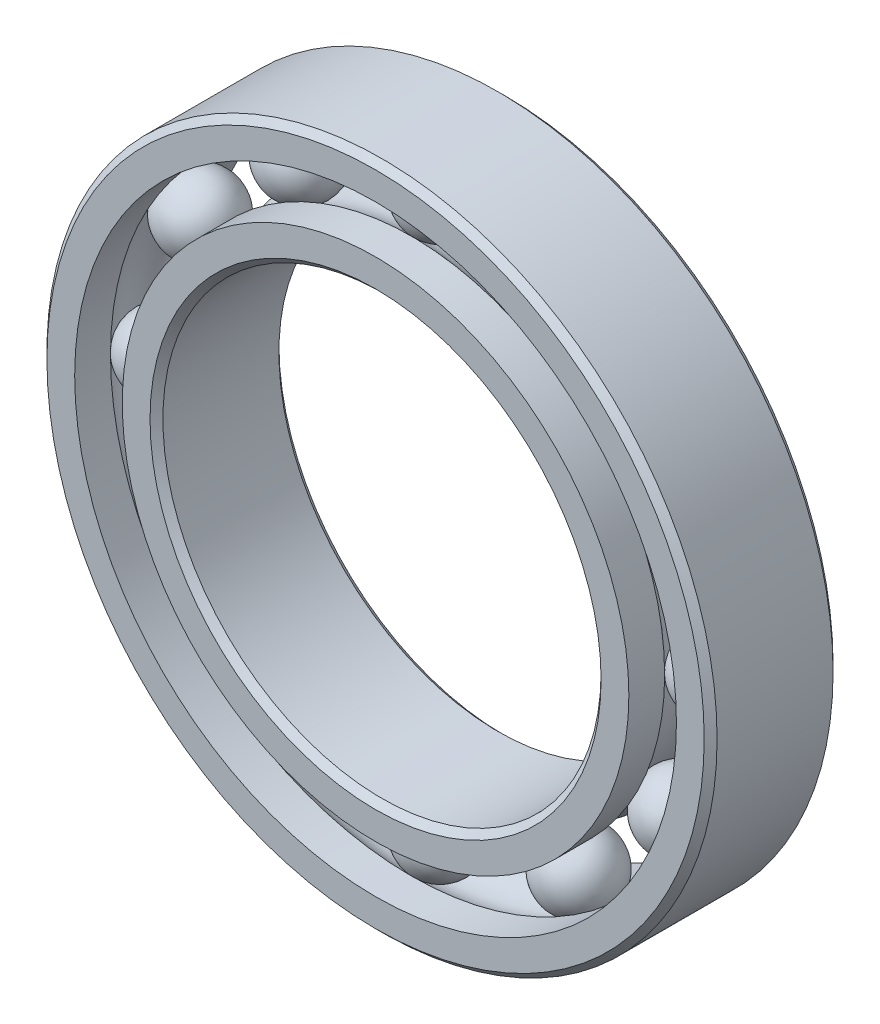
ISO-10303-21;
HEADER;
FILE_DESCRIPTION(('STEP AP214'),'2;1');
FILE_NAME('part.step','',(''),(''),'','','');
FILE_SCHEMA(('AUTOMOTIVE_DESIGN { 1 0 10303 214 1 1 1 1 }'));
ENDSEC;
DATA;
#1=APPLICATION_CONTEXT('core data for automotive mechanical design processes');
#2=APPLICATION_PROTOCOL_DEFINITION('international standard','automotive_design',2000,#1);
#3=PRODUCT_CONTEXT('',#1,'mechanical');
#4=PRODUCT('Part','Part','',(#3));
#5=PRODUCT_RELATED_PRODUCT_CATEGORY('part','',(#4));
#6=PRODUCT_DEFINITION_FORMATION('','',#4);
#7=PRODUCT_DEFINITION_CONTEXT('part definition',#1,'design');
#8=PRODUCT_DEFINITION('design','',#6,#7);
#9=PRODUCT_DEFINITION_SHAPE('','',#8);
#10=(LENGTH_UNIT() NAMED_UNIT(*) SI_UNIT(.MILLI.,.METRE.));
#11=(NAMED_UNIT(*) PLANE_ANGLE_UNIT() SI_UNIT($,.RADIAN.));
#12=(NAMED_UNIT(*) SI_UNIT($,.STERADIAN.) SOLID_ANGLE_UNIT());
#13=UNCERTAINTY_MEASURE_WITH_UNIT(LENGTH_MEASURE(1.E-05),#10,'distance_accuracy_value','');
#14=(GEOMETRIC_REPRESENTATION_CONTEXT(3) GLOBAL_UNCERTAINTY_ASSIGNED_CONTEXT((#13)) GLOBAL_UNIT_ASSIGNED_CONTEXT((#10,
#11,#12)) REPRESENTATION_CONTEXT('',''));
#15=CARTESIAN_POINT('',(0.,0.,0.));
#16=DIRECTION('',(0.,0.,1.));
#17=DIRECTION('',(1.,0.,0.));
#18=AXIS2_PLACEMENT_3D('',#15,#16,#17);
#19=CARTESIAN_POINT('',(-5.37499999999988,9.30977309068278,0.));
#20=DIRECTION('',(0.,0.,1.));
#21=DIRECTION('',(-0.499999999999989,0.866025403784445,0.));
#22=AXIS2_PLACEMENT_3D('',#19,#20,#21);
#23=SPHERICAL_SURFACE('',#22,1.44452030347507);
#24=CARTESIAN_POINT('',(-5.37499999999988,9.30977309068278,1.44452030347507));
#25=VERTEX_POINT('',#24);
#26=VERTEX_LOOP('',#25);
#27=FACE_BOUND('',#26,.T.);
#28=ADVANCED_FACE('F41',(#27),#23,.T.);
#29=CLOSED_SHELL('',(#28));
#30=MANIFOLD_SOLID_BREP('B2',#29);
#31=CARTESIAN_POINT('',(-9.30977309068265,5.37500000000011,0.));
#32=DIRECTION('',(0.,0.,1.));
#33=DIRECTION('',(-0.866025403784433,0.50000000000001,0.));
#34=AXIS2_PLACEMENT_3D('',#31,#32,#33);
#35=SPHERICAL_SURFACE('',#34,1.44452030347507);
#36=CARTESIAN_POINT('',(-9.30977309068265,5.37500000000011,1.44452030347507));
#37=VERTEX_POINT('',#36);
#38=VERTEX_LOOP('',#37);
#39=FACE_BOUND('',#38,.T.);
#40=ADVANCED_FACE('F61',(#39),#35,.T.);
#41=CLOSED_SHELL('',(#40));
#42=MANIFOLD_SOLID_BREP('B6',#41);
#43=CARTESIAN_POINT('',(-10.75,1.12600273177691E-13,0.));
#44=DIRECTION('',(0.,0.,1.));
#45=DIRECTION('',(-1.,0.,0.));
#46=AXIS2_PLACEMENT_3D('',#43,#44,#45);
#47=SPHERICAL_SURFACE('',#46,1.44452030347507);
#48=CARTESIAN_POINT('',(-10.75,1.12600273177691E-13,1.44452030347507));
#49=VERTEX_POINT('',#48);
#50=VERTEX_LOOP('',#49);
#51=FACE_BOUND('',#50,.T.);
#52=ADVANCED_FACE('F81',(#51),#47,.T.);
#53=CLOSED_SHELL('',(#52));
#54=MANIFOLD_SOLID_BREP('B37',#53);
#55=CARTESIAN_POINT('',(-9.30977309068276,-5.37499999999991,0.));
#56=DIRECTION('',(0.,0.,1.));
#57=DIRECTION('',(-0.866025403784443,-0.499999999999992,0.));
#58=AXIS2_PLACEMENT_3D('',#55,#56,#57);
#59=SPHERICAL_SURFACE('',#58,1.44452030347507);
#60=CARTESIAN_POINT('',(-9.30977309068276,-5.37499999999991,1.44452030347507));
#61=VERTEX_POINT('',#60);
#62=VERTEX_LOOP('',#61);
#63=FACE_BOUND('',#62,.T.);
#64=ADVANCED_FACE('F101',(#63),#59,.T.);
#65=CLOSED_SHELL('',(#64));
#66=MANIFOLD_SOLID_BREP('B57',#65);
#67=CARTESIAN_POINT('',(-5.37500000000008,-9.30977309068267,0.));
#68=DIRECTION('',(0.,0.,1.));
#69=DIRECTION('',(-0.500000000000007,-0.866025403784435,0.));
#70=AXIS2_PLACEMENT_3D('',#67,#68,#69);
#71=SPHERICAL_SURFACE('',#70,1.44452030347507);
#72=CARTESIAN_POINT('',(-5.37500000000008,-9.30977309068267,1.44452030347507));
#73=VERTEX_POINT('',#72);
#74=VERTEX_LOOP('',#73);
#75=FACE_BOUND('',#74,.T.);
#76=ADVANCED_FACE('F121',(#75),#71,.T.);
#77=CLOSED_SHELL('',(#76));
#78=MANIFOLD_SOLID_BREP('B77',#77);
#79=CARTESIAN_POINT('',(0.,-10.75,0.));
#80=DIRECTION('',(0.,0.,1.));
#81=DIRECTION('',(0.,-1.,0.));
#82=AXIS2_PLACEMENT_3D('',#79,#80,#81);
#83=SPHERICAL_SURFACE('',#82,1.44452030347507);
#84=CARTESIAN_POINT('',(0.,-10.75,1.44452030347507));
#85=VERTEX_POINT('',#84);
#86=VERTEX_LOOP('',#85);
#87=FACE_BOUND('',#86,.T.);
#88=ADVANCED_FACE('F141',(#87),#83,.T.);
#89=CLOSED_SHELL('',(#88));
#90=MANIFOLD_SOLID_BREP('B97',#89);
#91=CARTESIAN_POINT('',(5.37499999999994,-9.30977309068275,0.));
#92=DIRECTION('',(0.,0.,1.));
#93=DIRECTION('',(0.499999999999995,-0.866025403784442,0.));
#94=AXIS2_PLACEMENT_3D('',#91,#92,#93);
#95=SPHERICAL_SURFACE('',#94,1.44452030347507);
#96=CARTESIAN_POINT('',(5.37499999999994,-9.30977309068275,1.44452030347507));
#97=VERTEX_POINT('',#96);
#98=VERTEX_LOOP('',#97);
#99=FACE_BOUND('',#98,.T.);
#100=ADVANCED_FACE('F161',(#99),#95,.T.);
#101=CLOSED_SHELL('',(#100));
#102=MANIFOLD_SOLID_BREP('B117',#101);
#103=CARTESIAN_POINT('',(9.30977309068269,-5.37500000000004,0.));
#104=DIRECTION('',(0.,0.,1.));
#105=DIRECTION('',(0.866025403784436,-0.500000000000004,0.));
#106=AXIS2_PLACEMENT_3D('',#103,#104,#105);
#107=SPHERICAL_SURFACE('',#106,1.44452030347507);
#108=CARTESIAN_POINT('',(9.30977309068269,-5.37500000000004,1.44452030347507));
#109=VERTEX_POINT('',#108);
#110=VERTEX_LOOP('',#109);
#111=FACE_BOUND('',#110,.T.);
#112=ADVANCED_FACE('F181',(#111),#107,.T.);
#113=CLOSED_SHELL('',(#112));
#114=MANIFOLD_SOLID_BREP('B137',#113);
#115=CARTESIAN_POINT('',(10.75,0.,0.));
#116=DIRECTION('',(0.,0.,1.));
#117=DIRECTION('',(1.,0.,0.));
#118=AXIS2_PLACEMENT_3D('',#115,#116,#117);
#119=SPHERICAL_SURFACE('',#118,1.44452030347507);
#120=CARTESIAN_POINT('',(10.75,0.,1.44452030347507));
#121=VERTEX_POINT('',#120);
#122=VERTEX_LOOP('',#121);
#123=FACE_BOUND('',#122,.T.);
#124=ADVANCED_FACE('F201',(#123),#119,.T.);
#125=CLOSED_SHELL('',(#124));
#126=MANIFOLD_SOLID_BREP('B157',#125);
#127=CARTESIAN_POINT('',(9.30977309068273,5.37499999999998,0.));
#128=DIRECTION('',(0.,0.,1.));
#129=DIRECTION('',(0.86602540378444,0.499999999999998,0.));
#130=AXIS2_PLACEMENT_3D('',#127,#128,#129);
#131=SPHERICAL_SURFACE('',#130,1.44452030347507);
#132=CARTESIAN_POINT('',(9.30977309068273,5.37499999999998,1.44452030347507));
#133=VERTEX_POINT('',#132);
#134=VERTEX_LOOP('',#133);
#135=FACE_BOUND('',#134,.T.);
#136=ADVANCED_FACE('F221',(#135),#131,.T.);
#137=CLOSED_SHELL('',(#136));
#138=MANIFOLD_SOLID_BREP('B177',#137);
#139=CARTESIAN_POINT('',(5.37500000000001,9.30977309068271,0.));
#140=DIRECTION('',(0.,0.,1.));
#141=DIRECTION('',(0.500000000000001,0.866025403784438,0.));
#142=AXIS2_PLACEMENT_3D('',#139,#140,#141);
#143=SPHERICAL_SURFACE('',#142,1.44452030347507);
#144=CARTESIAN_POINT('',(5.37500000000001,9.30977309068271,1.44452030347507));
#145=VERTEX_POINT('',#144);
#146=VERTEX_LOOP('',#145);
#147=FACE_BOUND('',#146,.T.);
#148=ADVANCED_FACE('F241',(#147),#143,.T.);
#149=CLOSED_SHELL('',(#148));
#150=MANIFOLD_SOLID_BREP('B197',#149);
#151=CARTESIAN_POINT('',(0.,10.75,0.));
#152=DIRECTION('',(0.,0.,1.));
#153=DIRECTION('',(0.,1.,0.));
#154=AXIS2_PLACEMENT_3D('',#151,#152,#153);
#155=SPHERICAL_SURFACE('',#154,1.44452030347507);
#156=CARTESIAN_POINT('',(0.,10.75,1.44452030347507));
#157=VERTEX_POINT('',#156);
#158=VERTEX_LOOP('',#157);
#159=FACE_BOUND('',#158,.T.);
#160=ADVANCED_FACE('F263',(#159),#155,.T.);
#161=CLOSED_SHELL('',(#160));
#162=MANIFOLD_SOLID_BREP('B217',#161);
#163=CARTESIAN_POINT('',(0.,9.82692307692308,2.50000000000001));
#164=DIRECTION('',(0.,0.,-1.));
#165=DIRECTION('',(-1.,0.,0.));
#166=AXIS2_PLACEMENT_3D('',#163,#164,#165);
#167=PLANE('',#166);
#168=CARTESIAN_POINT('',(0.,0.,2.5));
#169=DIRECTION('',(0.,0.,1.));
#170=DIRECTION('',(1.,0.,0.));
#171=AXIS2_PLACEMENT_3D('',#168,#169,#170);
#172=CIRCLE('',#171,8.75);
#173=CARTESIAN_POINT('',(8.75,0.,2.5));
#174=VERTEX_POINT('',#173);
#175=EDGE_CURVE('E310',#174,#174,#172,.T.);
#176=ORIENTED_EDGE('',*,*,#175,.F.);
#177=EDGE_LOOP('',(#176));
#178=FACE_BOUND('',#177,.T.);
#179=CARTESIAN_POINT('',(0.,0.,2.50000000000001));
#180=DIRECTION('',(0.,0.,1.));
#181=DIRECTION('',(1.,0.,0.));
#182=AXIS2_PLACEMENT_3D('',#179,#180,#181);
#183=CIRCLE('',#182,9.82692307692308);
#184=CARTESIAN_POINT('',(9.82692307692308,0.,2.50000000000001));
#185=VERTEX_POINT('',#184);
#186=EDGE_CURVE('E262',#185,#185,#183,.T.);
#187=ORIENTED_EDGE('',*,*,#186,.T.);
#188=EDGE_LOOP('',(#187));
#189=FACE_BOUND('',#188,.T.);
#190=ADVANCED_FACE('F282',(#178,#189),#167,.F.);
#191=CARTESIAN_POINT('',(0.,0.,2.5));
#192=DIRECTION('',(0.,0.,1.));
#193=DIRECTION('',(1.,0.,0.));
#194=AXIS2_PLACEMENT_3D('',#191,#192,#193);
#195=CYLINDRICAL_SURFACE('',#194,9.82692307692308);
#196=ORIENTED_EDGE('',*,*,#186,.F.);
#197=EDGE_LOOP('',(#196));
#198=FACE_BOUND('',#197,.T.);
#199=CARTESIAN_POINT('',(0.,0.,1.11111111111111));
#200=DIRECTION('',(0.,0.,1.));
#201=DIRECTION('',(1.,0.,0.));
#202=AXIS2_PLACEMENT_3D('',#199,#200,#201);
#203=CIRCLE('',#202,9.82692307692308);
#204=CARTESIAN_POINT('',(9.82692307692308,0.,1.11111111111111));
#205=VERTEX_POINT('',#204);
#206=EDGE_CURVE('E288',#205,#205,#203,.T.);
#207=ORIENTED_EDGE('',*,*,#206,.T.);
#208=EDGE_LOOP('',(#207));
#209=FACE_BOUND('',#208,.T.);
#210=ADVANCED_FACE('F317',(#198,#209),#195,.T.);
#211=CARTESIAN_POINT('',(0.,0.,0.));
#212=DIRECTION('',(0.,0.,1.));
#213=DIRECTION('',(1.,0.,0.));
#214=AXIS2_PLACEMENT_3D('',#211,#212,#213);
#215=TOROIDAL_SURFACE('',#214,10.75,1.44452030347507);
#216=ORIENTED_EDGE('',*,*,#206,.F.);
#217=EDGE_LOOP('',(#216));
#218=FACE_BOUND('',#217,.T.);
#219=CARTESIAN_POINT('',(0.,0.,-1.11111111111111));
#220=DIRECTION('',(0.,0.,1.));
#221=DIRECTION('',(1.,0.,0.));
#222=AXIS2_PLACEMENT_3D('',#219,#220,#221);
#223=CIRCLE('',#222,9.82692307692308);
#224=CARTESIAN_POINT('',(9.82692307692308,0.,-1.11111111111111));
#225=VERTEX_POINT('',#224);
#226=EDGE_CURVE('E292',#225,#225,#223,.T.);
#227=ORIENTED_EDGE('',*,*,#226,.T.);
#228=EDGE_LOOP('',(#227));
#229=FACE_BOUND('',#228,.T.);
#230=ADVANCED_FACE('F321',(#218,#229),#215,.F.);
#231=CARTESIAN_POINT('',(0.,0.,2.5));
#232=DIRECTION('',(0.,0.,1.));
#233=DIRECTION('',(1.,0.,0.));
#234=AXIS2_PLACEMENT_3D('',#231,#232,#233);
#235=CYLINDRICAL_SURFACE('',#234,9.82692307692308);
#236=ORIENTED_EDGE('',*,*,#226,.F.);
#237=EDGE_LOOP('',(#236));
#238=FACE_BOUND('',#237,.T.);
#239=CARTESIAN_POINT('',(0.,0.,-2.50000000000001));
#240=DIRECTION('',(0.,0.,1.));
#241=DIRECTION('',(1.,0.,0.));
#242=AXIS2_PLACEMENT_3D('',#239,#240,#241);
#243=CIRCLE('',#242,9.82692307692308);
#244=CARTESIAN_POINT('',(9.82692307692308,0.,-2.50000000000001));
#245=VERTEX_POINT('',#244);
#246=EDGE_CURVE('E296',#245,#245,#243,.T.);
#247=ORIENTED_EDGE('',*,*,#246,.T.);
#248=EDGE_LOOP('',(#247));
#249=FACE_BOUND('',#248,.T.);
#250=ADVANCED_FACE('F326',(#238,#249),#235,.T.);
#251=CARTESIAN_POINT('',(0.,8.75,-2.50000000000001));
#252=DIRECTION('',(0.,0.,1.));
#253=DIRECTION('',(1.,0.,0.));
#254=AXIS2_PLACEMENT_3D('',#251,#252,#253);
#255=PLANE('',#254);
#256=ORIENTED_EDGE('',*,*,#246,.F.);
#257=EDGE_LOOP('',(#256));
#258=FACE_BOUND('',#257,.T.);
#259=CARTESIAN_POINT('',(0.,0.,-2.50000000000001));
#260=DIRECTION('',(0.,0.,1.));
#261=DIRECTION('',(1.,0.,0.));
#262=AXIS2_PLACEMENT_3D('',#259,#260,#261);
#263=CIRCLE('',#262,8.75);
#264=CARTESIAN_POINT('',(8.75,0.,-2.50000000000001));
#265=VERTEX_POINT('',#264);
#266=EDGE_CURVE('E301',#265,#265,#263,.T.);
#267=ORIENTED_EDGE('',*,*,#266,.T.);
#268=EDGE_LOOP('',(#267));
#269=FACE_BOUND('',#268,.T.);
#270=ADVANCED_FACE('F332',(#258,#269),#255,.F.);
#271=CARTESIAN_POINT('',(0.,0.,-2.25000000000001));
#272=DIRECTION('',(0.,0.,-1.));
#273=DIRECTION('',(-1.,0.,0.));
#274=AXIS2_PLACEMENT_3D('',#271,#272,#273);
#275=CONICAL_SURFACE('',#274,8.5,0.785398163397448);
#276=ORIENTED_EDGE('',*,*,#266,.F.);
#277=EDGE_LOOP('',(#276));
#278=FACE_BOUND('',#277,.T.);
#279=CARTESIAN_POINT('',(0.,0.,-2.25000000000001));
#280=DIRECTION('',(0.,0.,1.));
#281=DIRECTION('',(1.,0.,0.));
#282=AXIS2_PLACEMENT_3D('',#279,#280,#281);
#283=CIRCLE('',#282,8.5);
#284=CARTESIAN_POINT('',(8.5,0.,-2.25000000000001));
#285=VERTEX_POINT('',#284);
#286=EDGE_CURVE('E304',#285,#285,#283,.T.);
#287=ORIENTED_EDGE('',*,*,#286,.T.);
#288=EDGE_LOOP('',(#287));
#289=FACE_BOUND('',#288,.T.);
#290=ADVANCED_FACE('F336',(#278,#289),#275,.F.);
#291=CARTESIAN_POINT('',(0.,0.,2.5));
#292=DIRECTION('',(0.,0.,1.));
#293=DIRECTION('',(1.,0.,0.));
#294=AXIS2_PLACEMENT_3D('',#291,#292,#293);
#295=CYLINDRICAL_SURFACE('',#294,8.5);
#296=ORIENTED_EDGE('',*,*,#286,.F.);
#297=EDGE_LOOP('',(#296));
#298=FACE_BOUND('',#297,.T.);
#299=CARTESIAN_POINT('',(0.,0.,2.25000000000001));
#300=DIRECTION('',(0.,0.,1.));
#301=DIRECTION('',(1.,0.,0.));
#302=AXIS2_PLACEMENT_3D('',#299,#300,#301);
#303=CIRCLE('',#302,8.5);
#304=CARTESIAN_POINT('',(8.5,0.,2.25000000000001));
#305=VERTEX_POINT('',#304);
#306=EDGE_CURVE('E307',#305,#305,#303,.T.);
#307=ORIENTED_EDGE('',*,*,#306,.T.);
#308=EDGE_LOOP('',(#307));
#309=FACE_BOUND('',#308,.T.);
#310=ADVANCED_FACE('F340',(#298,#309),#295,.F.);
#311=CARTESIAN_POINT('',(0.,0.,2.5));
#312=DIRECTION('',(0.,0.,1.));
#313=DIRECTION('',(1.,0.,0.));
#314=AXIS2_PLACEMENT_3D('',#311,#312,#313);
#315=CONICAL_SURFACE('',#314,8.75,0.785398163397453);
#316=ORIENTED_EDGE('',*,*,#306,.F.);
#317=EDGE_LOOP('',(#316));
#318=FACE_BOUND('',#317,.T.);
#319=ORIENTED_EDGE('',*,*,#175,.T.);
#320=EDGE_LOOP('',(#319));
#321=FACE_BOUND('',#320,.T.);
#322=ADVANCED_FACE('F314',(#318,#321),#315,.F.);
#323=CLOSED_SHELL('',(#190,#210,#230,#250,#270,#290,#310,#322));
#324=MANIFOLD_SOLID_BREP('B237',#323);
#325=CARTESIAN_POINT('',(0.,0.,2.25));
#326=DIRECTION('',(0.,0.,-1.));
#327=DIRECTION('',(-1.,0.,0.));
#328=AXIS2_PLACEMENT_3D('',#325,#326,#327);
#329=CONICAL_SURFACE('',#328,13.,0.785398163397448);
#330=CARTESIAN_POINT('',(0.,0.,2.5));
#331=DIRECTION('',(0.,0.,1.));
#332=DIRECTION('',(1.,0.,0.));
#333=AXIS2_PLACEMENT_3D('',#330,#331,#332);
#334=CIRCLE('',#333,12.75);
#335=CARTESIAN_POINT('',(12.75,0.,2.5));
#336=VERTEX_POINT('',#335);
#337=EDGE_CURVE('E431',#336,#336,#334,.T.);
#338=ORIENTED_EDGE('',*,*,#337,.F.);
#339=EDGE_LOOP('',(#338));
#340=FACE_BOUND('',#339,.T.);
#341=CARTESIAN_POINT('',(0.,0.,2.25));
#342=DIRECTION('',(0.,0.,1.));
#343=DIRECTION('',(1.,0.,0.));
#344=AXIS2_PLACEMENT_3D('',#341,#342,#343);
#345=CIRCLE('',#344,13.);
#346=CARTESIAN_POINT('',(13.,0.,2.25));
#347=VERTEX_POINT('',#346);
#348=EDGE_CURVE('E281',#347,#347,#345,.T.);
#349=ORIENTED_EDGE('',*,*,#348,.T.);
#350=EDGE_LOOP('',(#349));
#351=FACE_BOUND('',#350,.T.);
#352=ADVANCED_FACE('F403',(#340,#351),#329,.T.);
#353=CARTESIAN_POINT('',(0.,0.,2.5));
#354=DIRECTION('',(0.,0.,1.));
#355=DIRECTION('',(1.,0.,0.));
#356=AXIS2_PLACEMENT_3D('',#353,#354,#355);
#357=CYLINDRICAL_SURFACE('',#356,13.);
#358=ORIENTED_EDGE('',*,*,#348,.F.);
#359=EDGE_LOOP('',(#358));
#360=FACE_BOUND('',#359,.T.);
#361=CARTESIAN_POINT('',(0.,0.,-2.25000000000001));
#362=DIRECTION('',(0.,0.,1.));
#363=DIRECTION('',(1.,0.,0.));
#364=AXIS2_PLACEMENT_3D('',#361,#362,#363);
#365=CIRCLE('',#364,13.);
#366=CARTESIAN_POINT('',(13.,0.,-2.25000000000001));
#367=VERTEX_POINT('',#366);
#368=EDGE_CURVE('E409',#367,#367,#365,.T.);
#369=ORIENTED_EDGE('',*,*,#368,.T.);
#370=EDGE_LOOP('',(#369));
#371=FACE_BOUND('',#370,.T.);
#372=ADVANCED_FACE('F438',(#360,#371),#357,.T.);
#373=CARTESIAN_POINT('',(0.,0.,-2.50000000000001));
#374=DIRECTION('',(0.,0.,1.));
#375=DIRECTION('',(1.,0.,0.));
#376=AXIS2_PLACEMENT_3D('',#373,#374,#375);
#377=CONICAL_SURFACE('',#376,12.75,0.785398163397448);
#378=ORIENTED_EDGE('',*,*,#368,.F.);
#379=EDGE_LOOP('',(#378));
#380=FACE_BOUND('',#379,.T.);
#381=CARTESIAN_POINT('',(0.,0.,-2.50000000000001));
#382=DIRECTION('',(0.,0.,1.));
#383=DIRECTION('',(1.,0.,0.));
#384=AXIS2_PLACEMENT_3D('',#381,#382,#383);
#385=CIRCLE('',#384,12.75);
#386=CARTESIAN_POINT('',(12.75,0.,-2.50000000000001));
#387=VERTEX_POINT('',#386);
#388=EDGE_CURVE('E413',#387,#387,#385,.T.);
#389=ORIENTED_EDGE('',*,*,#388,.T.);
#390=EDGE_LOOP('',(#389));
#391=FACE_BOUND('',#390,.T.);
#392=ADVANCED_FACE('F442',(#380,#391),#377,.T.);
#393=CARTESIAN_POINT('',(0.,12.75,-2.50000000000001));
#394=DIRECTION('',(0.,0.,1.));
#395=DIRECTION('',(1.,0.,0.));
#396=AXIS2_PLACEMENT_3D('',#393,#394,#395);
#397=PLANE('',#396);
#398=ORIENTED_EDGE('',*,*,#388,.F.);
#399=EDGE_LOOP('',(#398));
#400=FACE_BOUND('',#399,.T.);
#401=CARTESIAN_POINT('',(0.,0.,-2.50000000000001));
#402=DIRECTION('',(0.,0.,1.));
#403=DIRECTION('',(1.,0.,0.));
#404=AXIS2_PLACEMENT_3D('',#401,#402,#403);
#405=CIRCLE('',#404,11.6730769230769);
#406=CARTESIAN_POINT('',(11.6730769230769,0.,-2.50000000000001));
#407=VERTEX_POINT('',#406);
#408=EDGE_CURVE('E417',#407,#407,#405,.T.);
#409=ORIENTED_EDGE('',*,*,#408,.T.);
#410=EDGE_LOOP('',(#409));
#411=FACE_BOUND('',#410,.T.);
#412=ADVANCED_FACE('F447',(#400,#411),#397,.F.);
#413=CARTESIAN_POINT('',(0.,0.,2.5));
#414=DIRECTION('',(0.,0.,1.));
#415=DIRECTION('',(1.,0.,0.));
#416=AXIS2_PLACEMENT_3D('',#413,#414,#415);
#417=CYLINDRICAL_SURFACE('',#416,11.6730769230769);
#418=ORIENTED_EDGE('',*,*,#408,.F.);
#419=EDGE_LOOP('',(#418));
#420=FACE_BOUND('',#419,.T.);
#421=CARTESIAN_POINT('',(0.,0.,-1.11111111111111));
#422=DIRECTION('',(0.,0.,1.));
#423=DIRECTION('',(1.,0.,0.));
#424=AXIS2_PLACEMENT_3D('',#421,#422,#423);
#425=CIRCLE('',#424,11.6730769230769);
#426=CARTESIAN_POINT('',(11.6730769230769,0.,-1.11111111111111));
#427=VERTEX_POINT('',#426);
#428=EDGE_CURVE('E422',#427,#427,#425,.T.);
#429=ORIENTED_EDGE('',*,*,#428,.T.);
#430=EDGE_LOOP('',(#429));
#431=FACE_BOUND('',#430,.T.);
#432=ADVANCED_FACE('F453',(#420,#431),#417,.F.);
#433=CARTESIAN_POINT('',(0.,0.,0.));
#434=DIRECTION('',(0.,0.,1.));
#435=DIRECTION('',(1.,0.,0.));
#436=AXIS2_PLACEMENT_3D('',#433,#434,#435);
#437=TOROIDAL_SURFACE('',#436,10.75,1.44452030347507);
#438=ORIENTED_EDGE('',*,*,#428,.F.);
#439=EDGE_LOOP('',(#438));
#440=FACE_BOUND('',#439,.T.);
#441=CARTESIAN_POINT('',(0.,0.,1.11111111111111));
#442=DIRECTION('',(0.,0.,1.));
#443=DIRECTION('',(1.,0.,0.));
#444=AXIS2_PLACEMENT_3D('',#441,#442,#443);
#445=CIRCLE('',#444,11.6730769230769);
#446=CARTESIAN_POINT('',(11.6730769230769,0.,1.11111111111111));
#447=VERTEX_POINT('',#446);
#448=EDGE_CURVE('E425',#447,#447,#445,.T.);
#449=ORIENTED_EDGE('',*,*,#448,.T.);
#450=EDGE_LOOP('',(#449));
#451=FACE_BOUND('',#450,.T.);
#452=ADVANCED_FACE('F457',(#440,#451),#437,.F.);
#453=CARTESIAN_POINT('',(0.,0.,2.5));
#454=DIRECTION('',(0.,0.,1.));
#455=DIRECTION('',(1.,0.,0.));
#456=AXIS2_PLACEMENT_3D('',#453,#454,#455);
#457=CYLINDRICAL_SURFACE('',#456,11.6730769230769);
#458=ORIENTED_EDGE('',*,*,#448,.F.);
#459=EDGE_LOOP('',(#458));
#460=FACE_BOUND('',#459,.T.);
#461=CARTESIAN_POINT('',(0.,0.,2.5));
#462=DIRECTION('',(0.,0.,1.));
#463=DIRECTION('',(1.,0.,0.));
#464=AXIS2_PLACEMENT_3D('',#461,#462,#463);
#465=CIRCLE('',#464,11.6730769230769);
#466=CARTESIAN_POINT('',(11.6730769230769,0.,2.5));
#467=VERTEX_POINT('',#466);
#468=EDGE_CURVE('E428',#467,#467,#465,.T.);
#469=ORIENTED_EDGE('',*,*,#468,.T.);
#470=EDGE_LOOP('',(#469));
#471=FACE_BOUND('',#470,.T.);
#472=ADVANCED_FACE('F461',(#460,#471),#457,.F.);
#473=CARTESIAN_POINT('',(0.,12.75,2.5));
#474=DIRECTION('',(0.,0.,-1.));
#475=DIRECTION('',(-1.,0.,0.));
#476=AXIS2_PLACEMENT_3D('',#473,#474,#475);
#477=PLANE('',#476);
#478=ORIENTED_EDGE('',*,*,#468,.F.);
#479=EDGE_LOOP('',(#478));
#480=FACE_BOUND('',#479,.T.);
#481=ORIENTED_EDGE('',*,*,#337,.T.);
#482=EDGE_LOOP('',(#481));
#483=FACE_BOUND('',#482,.T.);
#484=ADVANCED_FACE('F435',(#480,#483),#477,.F.);
#485=CLOSED_SHELL('',(#352,#372,#392,#412,#432,#452,#472,#484));
#486=MANIFOLD_SOLID_BREP('B257',#485);
#487=ADVANCED_BREP_SHAPE_REPRESENTATION('',(#18,#30,#42,#54,#66,#78,#90,#102,#114,#126,#138,
#150,#162,#324,#486),#14);
#488=SHAPE_DEFINITION_REPRESENTATION(#9,#487);
ENDSEC;
END-ISO-10303-21;
